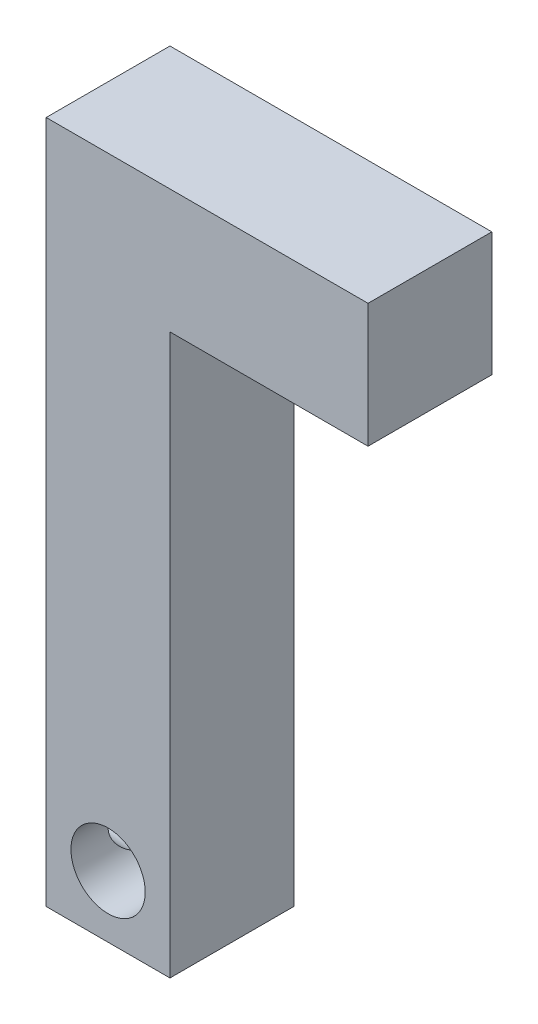
ISO-10303-21;
HEADER;
FILE_DESCRIPTION(('STEP AP214'),'2;1');
FILE_NAME('part.step','',(''),(''),'','','');
FILE_SCHEMA(('AUTOMOTIVE_DESIGN { 1 0 10303 214 1 1 1 1 }'));
ENDSEC;
DATA;
#1=APPLICATION_CONTEXT('core data for automotive mechanical design processes');
#2=APPLICATION_PROTOCOL_DEFINITION('international standard','automotive_design',2000,#1);
#3=PRODUCT_CONTEXT('',#1,'mechanical');
#4=PRODUCT('Part','Part','',(#3));
#5=PRODUCT_RELATED_PRODUCT_CATEGORY('part','',(#4));
#6=PRODUCT_DEFINITION_FORMATION('','',#4);
#7=PRODUCT_DEFINITION_CONTEXT('part definition',#1,'design');
#8=PRODUCT_DEFINITION('design','',#6,#7);
#9=PRODUCT_DEFINITION_SHAPE('','',#8);
#10=(LENGTH_UNIT() NAMED_UNIT(*) SI_UNIT(.MILLI.,.METRE.));
#11=(NAMED_UNIT(*) PLANE_ANGLE_UNIT() SI_UNIT($,.RADIAN.));
#12=(NAMED_UNIT(*) SI_UNIT($,.STERADIAN.) SOLID_ANGLE_UNIT());
#13=UNCERTAINTY_MEASURE_WITH_UNIT(LENGTH_MEASURE(1.E-05),#10,'distance_accuracy_value','');
#14=(GEOMETRIC_REPRESENTATION_CONTEXT(3) GLOBAL_UNCERTAINTY_ASSIGNED_CONTEXT((#13)) GLOBAL_UNIT_ASSIGNED_CONTEXT((#10,
#11,#12)) REPRESENTATION_CONTEXT('',''));
#15=CARTESIAN_POINT('',(0.,0.,0.));
#16=DIRECTION('',(0.,0.,1.));
#17=DIRECTION('',(1.,0.,0.));
#18=AXIS2_PLACEMENT_3D('',#15,#16,#17);
#19=CARTESIAN_POINT('',(0.,0.,6.35));
#20=DIRECTION('',(0.,0.,1.));
#21=DIRECTION('',(1.,0.,0.));
#22=AXIS2_PLACEMENT_3D('',#19,#20,#21);
#23=PLANE('',#22);
#24=CARTESIAN_POINT('',(3.175,-31.877,6.35));
#25=DIRECTION('',(0.,0.,1.));
#26=DIRECTION('',(1.,0.,0.));
#27=AXIS2_PLACEMENT_3D('',#24,#25,#26);
#28=CIRCLE('',#27,1.905);
#29=CARTESIAN_POINT('',(5.08,-31.877,6.35));
#30=VERTEX_POINT('',#29);
#31=EDGE_CURVE('E173',#30,#30,#28,.T.);
#32=ORIENTED_EDGE('',*,*,#31,.F.);
#33=EDGE_LOOP('',(#32));
#34=FACE_BOUND('',#33,.T.);
#35=DIRECTION('',(0.,-1.,0.));
#36=VECTOR('',#35,1.);
#37=CARTESIAN_POINT('',(16.51,0.,6.35));
#38=LINE('',#37,#36);
#39=CARTESIAN_POINT('',(16.51,0.,6.35));
#40=VERTEX_POINT('',#39);
#41=CARTESIAN_POINT('',(16.51,-6.35,6.35));
#42=VERTEX_POINT('',#41);
#43=EDGE_CURVE('E184',#40,#42,#38,.T.);
#44=ORIENTED_EDGE('',*,*,#43,.F.);
#45=DIRECTION('',(1.,0.,0.));
#46=VECTOR('',#45,1.);
#47=CARTESIAN_POINT('',(0.,0.,6.35));
#48=LINE('',#47,#46);
#49=CARTESIAN_POINT('',(0.,0.,6.35));
#50=VERTEX_POINT('',#49);
#51=EDGE_CURVE('E188',#50,#40,#48,.T.);
#52=ORIENTED_EDGE('',*,*,#51,.F.);
#53=DIRECTION('',(0.,-1.,0.));
#54=VECTOR('',#53,1.);
#55=CARTESIAN_POINT('',(0.,0.,6.35));
#56=LINE('',#55,#54);
#57=CARTESIAN_POINT('',(0.,-35.052,6.35));
#58=VERTEX_POINT('',#57);
#59=EDGE_CURVE('E137',#50,#58,#56,.T.);
#60=ORIENTED_EDGE('',*,*,#59,.T.);
#61=DIRECTION('',(1.,0.,0.));
#62=VECTOR('',#61,1.);
#63=CARTESIAN_POINT('',(0.,-35.052,6.35));
#64=LINE('',#63,#62);
#65=CARTESIAN_POINT('',(6.35,-35.052,6.35));
#66=VERTEX_POINT('',#65);
#67=EDGE_CURVE('E150',#58,#66,#64,.T.);
#68=ORIENTED_EDGE('',*,*,#67,.T.);
#69=DIRECTION('',(0.,-1.,0.));
#70=VECTOR('',#69,1.);
#71=CARTESIAN_POINT('',(6.35,0.,6.35));
#72=LINE('',#71,#70);
#73=CARTESIAN_POINT('',(6.35,-6.35,6.35));
#74=VERTEX_POINT('',#73);
#75=EDGE_CURVE('E146',#74,#66,#72,.T.);
#76=ORIENTED_EDGE('',*,*,#75,.F.);
#77=DIRECTION('',(1.,0.,0.));
#78=VECTOR('',#77,1.);
#79=CARTESIAN_POINT('',(0.,-6.35,6.35));
#80=LINE('',#79,#78);
#81=EDGE_CURVE('E85',#74,#42,#80,.T.);
#82=ORIENTED_EDGE('',*,*,#81,.T.);
#83=EDGE_LOOP('',(#44,#52,#60,#68,#76,#82));
#84=FACE_BOUND('',#83,.T.);
#85=ADVANCED_FACE('F65',(#34,#84),#23,.T.);
#86=CARTESIAN_POINT('',(16.51,0.,6.35));
#87=DIRECTION('',(1.,0.,0.));
#88=DIRECTION('',(0.,0.,-1.));
#89=AXIS2_PLACEMENT_3D('',#86,#87,#88);
#90=PLANE('',#89);
#91=DIRECTION('',(0.,-1.,0.));
#92=VECTOR('',#91,1.);
#93=CARTESIAN_POINT('',(16.51,0.,0.));
#94=LINE('',#93,#92);
#95=CARTESIAN_POINT('',(16.51,0.,0.));
#96=VERTEX_POINT('',#95);
#97=CARTESIAN_POINT('',(16.51,-6.35,0.));
#98=VERTEX_POINT('',#97);
#99=EDGE_CURVE('E134',#96,#98,#94,.T.);
#100=ORIENTED_EDGE('',*,*,#99,.F.);
#101=DIRECTION('',(0.,0.,-1.));
#102=VECTOR('',#101,1.);
#103=CARTESIAN_POINT('',(16.51,0.,6.35));
#104=LINE('',#103,#102);
#105=EDGE_CURVE('E12',#40,#96,#104,.T.);
#106=ORIENTED_EDGE('',*,*,#105,.F.);
#107=ORIENTED_EDGE('',*,*,#43,.T.);
#108=DIRECTION('',(0.,0.,-1.));
#109=VECTOR('',#108,1.);
#110=CARTESIAN_POINT('',(16.51,-6.35,6.35));
#111=LINE('',#110,#109);
#112=EDGE_CURVE('E193',#42,#98,#111,.T.);
#113=ORIENTED_EDGE('',*,*,#112,.T.);
#114=EDGE_LOOP('',(#100,#106,#107,#113));
#115=FACE_BOUND('',#114,.T.);
#116=ADVANCED_FACE('F205',(#115),#90,.T.);
#117=CARTESIAN_POINT('',(0.,0.,0.));
#118=DIRECTION('',(0.,0.,1.));
#119=DIRECTION('',(1.,0.,0.));
#120=AXIS2_PLACEMENT_3D('',#117,#118,#119);
#121=PLANE('',#120);
#122=CARTESIAN_POINT('',(3.175,-31.877,0.));
#123=DIRECTION('',(0.,0.,1.));
#124=DIRECTION('',(1.,0.,0.));
#125=AXIS2_PLACEMENT_3D('',#122,#123,#124);
#126=CIRCLE('',#125,1.905);
#127=CARTESIAN_POINT('',(5.08,-31.877,0.));
#128=VERTEX_POINT('',#127);
#129=EDGE_CURVE('E169',#128,#128,#126,.T.);
#130=ORIENTED_EDGE('',*,*,#129,.T.);
#131=EDGE_LOOP('',(#130));
#132=FACE_BOUND('',#131,.T.);
#133=ORIENTED_EDGE('',*,*,#99,.T.);
#134=DIRECTION('',(1.,0.,0.));
#135=VECTOR('',#134,1.);
#136=CARTESIAN_POINT('',(0.,-6.35,0.));
#137=LINE('',#136,#135);
#138=CARTESIAN_POINT('',(6.35,-6.35,0.));
#139=VERTEX_POINT('',#138);
#140=EDGE_CURVE('E133',#139,#98,#137,.T.);
#141=ORIENTED_EDGE('',*,*,#140,.F.);
#142=DIRECTION('',(0.,-1.,0.));
#143=VECTOR('',#142,1.);
#144=CARTESIAN_POINT('',(6.35,0.,0.));
#145=LINE('',#144,#143);
#146=CARTESIAN_POINT('',(6.35,-35.052,0.));
#147=VERTEX_POINT('',#146);
#148=EDGE_CURVE('E152',#139,#147,#145,.T.);
#149=ORIENTED_EDGE('',*,*,#148,.T.);
#150=DIRECTION('',(1.,0.,0.));
#151=VECTOR('',#150,1.);
#152=CARTESIAN_POINT('',(0.,-35.052,0.));
#153=LINE('',#152,#151);
#154=CARTESIAN_POINT('',(0.,-35.052,0.));
#155=VERTEX_POINT('',#154);
#156=EDGE_CURVE('E144',#155,#147,#153,.T.);
#157=ORIENTED_EDGE('',*,*,#156,.F.);
#158=DIRECTION('',(0.,-1.,0.));
#159=VECTOR('',#158,1.);
#160=CARTESIAN_POINT('',(0.,0.,0.));
#161=LINE('',#160,#159);
#162=CARTESIAN_POINT('',(0.,0.,0.));
#163=VERTEX_POINT('',#162);
#164=EDGE_CURVE('E117',#163,#155,#161,.T.);
#165=ORIENTED_EDGE('',*,*,#164,.F.);
#166=DIRECTION('',(1.,0.,0.));
#167=VECTOR('',#166,1.);
#168=CARTESIAN_POINT('',(0.,0.,0.));
#169=LINE('',#168,#167);
#170=EDGE_CURVE('E123',#163,#96,#169,.T.);
#171=ORIENTED_EDGE('',*,*,#170,.T.);
#172=EDGE_LOOP('',(#133,#141,#149,#157,#165,#171));
#173=FACE_BOUND('',#172,.T.);
#174=ADVANCED_FACE('F142',(#132,#173),#121,.F.);
#175=CARTESIAN_POINT('',(0.,-6.35,6.35));
#176=DIRECTION('',(0.,1.,0.));
#177=DIRECTION('',(0.,0.,1.));
#178=AXIS2_PLACEMENT_3D('',#175,#176,#177);
#179=PLANE('',#178);
#180=ORIENTED_EDGE('',*,*,#140,.T.);
#181=ORIENTED_EDGE('',*,*,#112,.F.);
#182=ORIENTED_EDGE('',*,*,#81,.F.);
#183=DIRECTION('',(0.,0.,-1.));
#184=VECTOR('',#183,1.);
#185=CARTESIAN_POINT('',(6.35,-6.35,6.35));
#186=LINE('',#185,#184);
#187=EDGE_CURVE('E76',#74,#139,#186,.T.);
#188=ORIENTED_EDGE('',*,*,#187,.T.);
#189=EDGE_LOOP('',(#180,#181,#182,#188));
#190=FACE_BOUND('',#189,.T.);
#191=ADVANCED_FACE('F203',(#190),#179,.F.);
#192=CARTESIAN_POINT('',(0.,0.,6.35));
#193=DIRECTION('',(0.,1.,0.));
#194=DIRECTION('',(0.,0.,1.));
#195=AXIS2_PLACEMENT_3D('',#192,#193,#194);
#196=PLANE('',#195);
#197=ORIENTED_EDGE('',*,*,#170,.F.);
#198=DIRECTION('',(0.,0.,-1.));
#199=VECTOR('',#198,1.);
#200=CARTESIAN_POINT('',(0.,0.,6.35));
#201=LINE('',#200,#199);
#202=EDGE_CURVE('E126',#50,#163,#201,.T.);
#203=ORIENTED_EDGE('',*,*,#202,.F.);
#204=ORIENTED_EDGE('',*,*,#51,.T.);
#205=ORIENTED_EDGE('',*,*,#105,.T.);
#206=EDGE_LOOP('',(#197,#203,#204,#205));
#207=FACE_BOUND('',#206,.T.);
#208=ADVANCED_FACE('F124',(#207),#196,.T.);
#209=CARTESIAN_POINT('',(0.,0.,6.35));
#210=DIRECTION('',(1.,0.,0.));
#211=DIRECTION('',(0.,1.,0.));
#212=AXIS2_PLACEMENT_3D('',#209,#210,#211);
#213=PLANE('',#212);
#214=CARTESIAN_POINT('',(0.,-31.877,3.175));
#215=DIRECTION('',(-1.,0.,0.));
#216=DIRECTION('',(0.,-1.,0.));
#217=AXIS2_PLACEMENT_3D('',#214,#215,#216);
#218=CIRCLE('',#217,1.27);
#219=CARTESIAN_POINT('',(0.,-33.147,3.175));
#220=VERTEX_POINT('',#219);
#221=EDGE_CURVE('E179',#220,#220,#218,.T.);
#222=ORIENTED_EDGE('',*,*,#221,.F.);
#223=EDGE_LOOP('',(#222));
#224=FACE_BOUND('',#223,.T.);
#225=ORIENTED_EDGE('',*,*,#164,.T.);
#226=DIRECTION('',(0.,0.,-1.));
#227=VECTOR('',#226,1.);
#228=CARTESIAN_POINT('',(0.,-35.052,6.35));
#229=LINE('',#228,#227);
#230=EDGE_CURVE('E139',#58,#155,#229,.T.);
#231=ORIENTED_EDGE('',*,*,#230,.F.);
#232=ORIENTED_EDGE('',*,*,#59,.F.);
#233=ORIENTED_EDGE('',*,*,#202,.T.);
#234=EDGE_LOOP('',(#225,#231,#232,#233));
#235=FACE_BOUND('',#234,.T.);
#236=ADVANCED_FACE('F136',(#224,#235),#213,.F.);
#237=CARTESIAN_POINT('',(0.,-35.052,6.35));
#238=DIRECTION('',(0.,1.,0.));
#239=DIRECTION('',(0.,0.,1.));
#240=AXIS2_PLACEMENT_3D('',#237,#238,#239);
#241=PLANE('',#240);
#242=ORIENTED_EDGE('',*,*,#156,.T.);
#243=DIRECTION('',(0.,0.,-1.));
#244=VECTOR('',#243,1.);
#245=CARTESIAN_POINT('',(6.35,-35.052,6.35));
#246=LINE('',#245,#244);
#247=EDGE_CURVE('E69',#66,#147,#246,.T.);
#248=ORIENTED_EDGE('',*,*,#247,.F.);
#249=ORIENTED_EDGE('',*,*,#67,.F.);
#250=ORIENTED_EDGE('',*,*,#230,.T.);
#251=EDGE_LOOP('',(#242,#248,#249,#250));
#252=FACE_BOUND('',#251,.T.);
#253=ADVANCED_FACE('F225',(#252),#241,.F.);
#254=CARTESIAN_POINT('',(6.35,0.,6.35));
#255=DIRECTION('',(1.,0.,0.));
#256=DIRECTION('',(0.,1.,0.));
#257=AXIS2_PLACEMENT_3D('',#254,#255,#256);
#258=PLANE('',#257);
#259=ORIENTED_EDGE('',*,*,#187,.F.);
#260=ORIENTED_EDGE('',*,*,#75,.T.);
#261=ORIENTED_EDGE('',*,*,#247,.T.);
#262=ORIENTED_EDGE('',*,*,#148,.F.);
#263=EDGE_LOOP('',(#259,#260,#261,#262));
#264=FACE_BOUND('',#263,.T.);
#265=ADVANCED_FACE('F67',(#264),#258,.T.);
#266=CARTESIAN_POINT('',(3.175,-31.877,0.));
#267=DIRECTION('',(0.,0.,1.));
#268=DIRECTION('',(1.,0.,0.));
#269=AXIS2_PLACEMENT_3D('',#266,#267,#268);
#270=CYLINDRICAL_SURFACE('',#269,1.905);
#271=CARTESIAN_POINT('',(1.75509683428764,-33.147,3.175));
#272=CARTESIAN_POINT('',(1.75509076551112,-33.1469965328856,3.11300602259843));
#273=CARTESIAN_POINT('',(1.75096124884875,-33.1424216023983,3.05099037139491));
#274=CARTESIAN_POINT('',(1.73525197461473,-33.1245100038176,2.92917885610173));
#275=CARTESIAN_POINT('',(1.72365885383929,-33.1111576192329,2.86938717743873));
#276=CARTESIAN_POINT('',(1.69509068000763,-33.0767427216466,2.75416299440767));
#277=CARTESIAN_POINT('',(1.67816808260428,-33.0557550593903,2.69869431257159));
#278=CARTESIAN_POINT('',(1.64094099877041,-33.006880953299,2.59215519645987));
#279=CARTESIAN_POINT('',(1.62063581029143,-32.9789930767572,2.54108567856494));
#280=CARTESIAN_POINT('',(1.57514243688164,-32.912065303549,2.43608422636326));
#281=CARTESIAN_POINT('',(1.54968615582619,-32.8719652151185,2.38294410524958));
#282=CARTESIAN_POINT('',(1.49895034659368,-32.7839020453533,2.28345827986483));
#283=CARTESIAN_POINT('',(1.4736710157078,-32.7359313096745,2.23711927374684));
#284=CARTESIAN_POINT('',(1.42183600237421,-32.6251296346388,2.14589127667365));
#285=CARTESIAN_POINT('',(1.39562340987204,-32.561153089183,2.10217860502245));
#286=CARTESIAN_POINT('',(1.34900362353445,-32.4246690622748,2.0265122693638));
#287=CARTESIAN_POINT('',(1.32858994993292,-32.3521712317243,1.99454546859019));
#288=CARTESIAN_POINT('',(1.297940587599,-32.2092631616598,1.94719168535392));
#289=CARTESIAN_POINT('',(1.28682003483924,-32.1395310504902,1.93034707624532));
#290=CARTESIAN_POINT('',(1.2724781163168,-31.9974566099435,1.90869284930488));
#291=CARTESIAN_POINT('',(1.26924680260902,-31.9251176846165,1.90386807489185));
#292=CARTESIAN_POINT('',(1.27091845305925,-31.7918166231025,1.90637950571765));
#293=CARTESIAN_POINT('',(1.27465921782069,-31.7307971948644,1.91197804758634));
#294=CARTESIAN_POINT('',(1.28772803928337,-31.6107834678729,1.93172781761291));
#295=CARTESIAN_POINT('',(1.2970565034618,-31.5517893171424,1.94587966951275));
#296=CARTESIAN_POINT('',(1.32046921768127,-31.4375305095788,1.98195925984456));
#297=CARTESIAN_POINT('',(1.33453455480999,-31.3822520538578,2.00385609210108));
#298=CARTESIAN_POINT('',(1.36638598657557,-31.276157189335,2.05457656327504));
#299=CARTESIAN_POINT('',(1.38417276031823,-31.2253415973444,2.08340146660346));
#300=CARTESIAN_POINT('',(1.42482532883804,-31.1224394746032,2.15136649828703));
#301=CARTESIAN_POINT('',(1.44805140417064,-31.0710634095669,2.19136437732902));
#302=CARTESIAN_POINT('',(1.49605617839857,-30.9753075723858,2.27831566147001));
#303=CARTESIAN_POINT('',(1.52083723762328,-30.9309388141514,2.32527979566797));
#304=CARTESIAN_POINT('',(1.57384721460463,-30.8433963056788,2.43329663848544));
#305=CARTESIAN_POINT('',(1.60201406794326,-30.8014776836476,2.4954046356187));
#306=CARTESIAN_POINT('',(1.65432987122257,-30.7286985440962,2.62731874790516));
#307=CARTESIAN_POINT('',(1.67848552075354,-30.6978194865414,2.69711169645285));
#308=CARTESIAN_POINT('',(1.71283077355119,-30.6556871989946,2.82239660441641));
#309=CARTESIAN_POINT('',(1.72503868493161,-30.6413484724031,2.87629178998606));
#310=CARTESIAN_POINT('',(1.74365259733616,-30.619829822067,2.98643007603375));
#311=CARTESIAN_POINT('',(1.75006865643279,-30.6126374857763,3.04266892809481));
#312=CARTESIAN_POINT('',(1.75610801312944,-30.6058608090544,3.15623129639015));
#313=CARTESIAN_POINT('',(1.75570175994513,-30.6063095660671,3.21355845635954));
#314=CARTESIAN_POINT('',(1.74809225965993,-30.6148636513018,3.32719923456219));
#315=CARTESIAN_POINT('',(1.7408835029402,-30.6229751859187,3.38351199351094));
#316=CARTESIAN_POINT('',(1.72130734286037,-30.6457361989597,3.49084228014153));
#317=CARTESIAN_POINT('',(1.70920926207102,-30.6600467917254,3.5419840952071));
#318=CARTESIAN_POINT('',(1.68128976334741,-30.6944836856682,3.64117015990148));
#319=CARTESIAN_POINT('',(1.66546709531357,-30.7146119399705,3.68921336261706));
#320=CARTESIAN_POINT('',(1.62806707900366,-30.7647127490503,3.79107827239823));
#321=CARTESIAN_POINT('',(1.60597163223596,-30.7958488168329,3.8441355751513));
#322=CARTESIAN_POINT('',(1.56043303030275,-30.8651101547901,3.94488466947952));
#323=CARTESIAN_POINT('',(1.53698825838576,-30.9032439344866,3.99256981307836));
#324=CARTESIAN_POINT('',(1.4854194429017,-30.9951332235889,4.09191609070725));
#325=CARTESIAN_POINT('',(1.45739197898391,-31.0504815456515,4.14217030865506));
#326=CARTESIAN_POINT('',(1.40477505524181,-31.1701818246828,4.23279359364971));
#327=CARTESIAN_POINT('',(1.38018256607155,-31.2345257468108,4.27317139474383));
#328=CARTESIAN_POINT('',(1.34117828512433,-31.3578954534914,4.33571125421606));
#329=CARTESIAN_POINT('',(1.32571834099843,-31.4155693982981,4.35988238032054));
#330=CARTESIAN_POINT('',(1.29998020504096,-31.5348892548211,4.39966556839257));
#331=CARTESIAN_POINT('',(1.28969763731195,-31.5965317624494,4.41528485931571));
#332=CARTESIAN_POINT('',(1.27521738843106,-31.7224604358875,4.43718757203785));
#333=CARTESIAN_POINT('',(1.27104679206126,-31.7867570785531,4.4434294414868));
#334=CARTESIAN_POINT('',(1.26930263646526,-31.9156432720787,4.44604638564979));
#335=CARTESIAN_POINT('',(1.27172846403791,-31.9802327951554,4.44242237749215));
#336=CARTESIAN_POINT('',(1.28251231954405,-32.1029060331554,4.42616622448203));
#337=CARTESIAN_POINT('',(1.29042618971743,-32.1611213158498,4.41420822461275));
#338=CARTESIAN_POINT('',(1.31104572558596,-32.2745216986031,4.38261886401137));
#339=CARTESIAN_POINT('',(1.3237521356559,-32.3297063264162,4.36298631125448));
#340=CARTESIAN_POINT('',(1.35387228916267,-32.4390685333463,4.31549892239864));
#341=CARTESIAN_POINT('',(1.37151586919075,-32.4930030791422,4.28723405474062));
#342=CARTESIAN_POINT('',(1.40985615770475,-32.5955359408038,4.2239243406625));
#343=CARTESIAN_POINT('',(1.43055469130258,-32.6441310362518,4.18887543735048));
#344=CARTESIAN_POINT('',(1.4770548851503,-32.7426918309789,4.10678064701644));
#345=CARTESIAN_POINT('',(1.5031471468787,-32.7916710149907,4.05871487996698));
#346=CARTESIAN_POINT('',(1.55541117892576,-32.8813161414881,3.95534290111839));
#347=CARTESIAN_POINT('',(1.58158299398952,-32.9219758648569,3.90003132309035));
#348=CARTESIAN_POINT('',(1.62951024370161,-32.9915091598419,3.78722407987039));
#349=CARTESIAN_POINT('',(1.65145029918891,-33.0210455077973,3.73021745068153));
#350=CARTESIAN_POINT('',(1.69070336489701,-33.0715353448607,3.61106437488934));
#351=CARTESIAN_POINT('',(1.70802534127482,-33.0925055082865,3.54892819939753));
#352=CARTESIAN_POINT('',(1.73233682024743,-33.1211952666903,3.43486011755041));
#353=CARTESIAN_POINT('',(1.74076553414554,-33.1308216501701,3.38371926963816));
#354=CARTESIAN_POINT('',(1.75214585297835,-33.1437228654502,3.28005668567962));
#355=CARTESIAN_POINT('',(1.75510197720663,-33.1470029381686,3.22753612539453));
#356=CARTESIAN_POINT('',(1.75509683428764,-33.147,3.175));
#357=B_SPLINE_CURVE_WITH_KNOTS('',3,(#271,#272,#273,#274,#275,#276,#277,#278,#279,#280,#281,
#282,#283,#284,#285,#286,#287,#288,#289,#290,#291,#292,#293,#294,#295,#296,#297,#298,#299,#300,
#301,#302,#303,#304,#305,#306,#307,#308,#309,#310,#311,#312,#313,#314,#315,#316,#317,#318,#319,
#320,#321,#322,#323,#324,#325,#326,#327,#328,#329,#330,#331,#332,#333,#334,#335,#336,#337,#338,
#339,#340,#341,#342,#343,#344,#345,#346,#347,#348,#349,#350,#351,#352,#353,#354,#355,#356),
.UNSPECIFIED.,.T.,.F.,(4,2,2,2,2,2,2,2,2,2,2,2,2,2,2,2,2,2,2,2,2,2,2,2,2,2,2,2,2,2,2,2,2,2,2,2,
2,2,2,2,2,2,4),(0.,0.185741901008566,0.371817291834648,0.556115633522338,0.740452273642587,
0.953482199385848,1.16672054207034,1.41076064688994,1.65452697661748,1.87094801110374,
2.08709600797069,2.27037604696896,2.45366945310178,2.63623953302975,2.81884295833405,
3.02544178976113,3.23236218395865,3.47140976725639,3.71005398287407,3.88065067404841,
4.05095053559533,4.22198823900152,4.39316459167329,4.55597546833904,4.71884106804547,
4.91426011082439,5.1099183856791,5.34831724669763,5.5865045151254,5.7789481868738,
5.97122893183132,6.16435920582966,6.35747152712255,6.5365425672753,6.71564143210904,
6.90510342994998,7.09467907915192,7.31407100989619,7.53362635014766,7.73642169879869,
7.93882039771211,8.09635551352154,8.25376047786501),.UNSPECIFIED.);
#358=CARTESIAN_POINT('',(1.75509683428764,-33.147,3.175));
#359=VERTEX_POINT('',#358);
#360=EDGE_CURVE('E241',#359,#359,#357,.T.);
#361=ORIENTED_EDGE('',*,*,#360,.F.);
#362=EDGE_LOOP('',(#361));
#363=FACE_BOUND('',#362,.T.);
#364=ORIENTED_EDGE('',*,*,#129,.F.);
#365=EDGE_LOOP('',(#364));
#366=FACE_BOUND('',#365,.T.);
#367=ORIENTED_EDGE('',*,*,#31,.T.);
#368=EDGE_LOOP('',(#367));
#369=FACE_BOUND('',#368,.T.);
#370=ADVANCED_FACE('F216',(#363,#366,#369),#270,.F.);
#371=CARTESIAN_POINT('',(16.511,-31.877,3.175));
#372=DIRECTION('',(-1.,0.,0.));
#373=DIRECTION('',(0.,-1.,0.));
#374=AXIS2_PLACEMENT_3D('',#371,#372,#373);
#375=CYLINDRICAL_SURFACE('',#374,1.27);
#376=ORIENTED_EDGE('',*,*,#221,.T.);
#377=EDGE_LOOP('',(#376));
#378=FACE_BOUND('',#377,.T.);
#379=ORIENTED_EDGE('',*,*,#360,.T.);
#380=EDGE_LOOP('',(#379));
#381=FACE_BOUND('',#380,.T.);
#382=ADVANCED_FACE('F232',(#378,#381),#375,.F.);
#383=CLOSED_SHELL('',(#85,#116,#174,#191,#208,#236,#253,#265,#370,#382));
#384=MANIFOLD_SOLID_BREP('B2',#383);
#385=ADVANCED_BREP_SHAPE_REPRESENTATION('',(#18,#384),#14);
#386=SHAPE_DEFINITION_REPRESENTATION(#9,#385);
ENDSEC;
END-ISO-10303-21;
